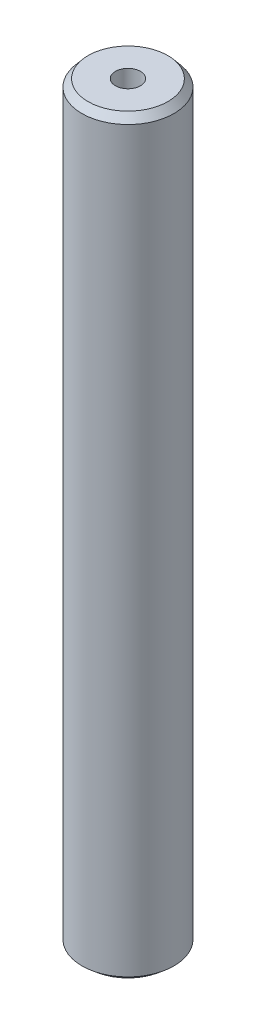
ISO-10303-21;
HEADER;
FILE_DESCRIPTION(('STEP AP214'),'2;1');
FILE_NAME('part.step','',(''),(''),'','','');
FILE_SCHEMA(('AUTOMOTIVE_DESIGN { 1 0 10303 214 1 1 1 1 }'));
ENDSEC;
DATA;
#1=APPLICATION_CONTEXT('core data for automotive mechanical design processes');
#2=APPLICATION_PROTOCOL_DEFINITION('international standard','automotive_design',2000,#1);
#3=PRODUCT_CONTEXT('',#1,'mechanical');
#4=PRODUCT('Part','Part','',(#3));
#5=PRODUCT_RELATED_PRODUCT_CATEGORY('part','',(#4));
#6=PRODUCT_DEFINITION_FORMATION('','',#4);
#7=PRODUCT_DEFINITION_CONTEXT('part definition',#1,'design');
#8=PRODUCT_DEFINITION('design','',#6,#7);
#9=PRODUCT_DEFINITION_SHAPE('','',#8);
#10=(LENGTH_UNIT() NAMED_UNIT(*) SI_UNIT(.MILLI.,.METRE.));
#11=(NAMED_UNIT(*) PLANE_ANGLE_UNIT() SI_UNIT($,.RADIAN.));
#12=(NAMED_UNIT(*) SI_UNIT($,.STERADIAN.) SOLID_ANGLE_UNIT());
#13=UNCERTAINTY_MEASURE_WITH_UNIT(LENGTH_MEASURE(1.E-05),#10,'distance_accuracy_value','');
#14=(GEOMETRIC_REPRESENTATION_CONTEXT(3) GLOBAL_UNCERTAINTY_ASSIGNED_CONTEXT((#13)) GLOBAL_UNIT_ASSIGNED_CONTEXT((#10,
#11,#12)) REPRESENTATION_CONTEXT('',''));
#15=CARTESIAN_POINT('',(0.,0.,0.));
#16=DIRECTION('',(0.,0.,1.));
#17=DIRECTION('',(1.,0.,0.));
#18=AXIS2_PLACEMENT_3D('',#15,#16,#17);
#19=CARTESIAN_POINT('',(0.,285.872211946887,0.));
#20=DIRECTION('',(0.,-1.,0.));
#21=DIRECTION('',(0.,0.,-1.));
#22=AXIS2_PLACEMENT_3D('',#19,#20,#21);
#23=CYLINDRICAL_SURFACE('',#22,17.5);
#24=CARTESIAN_POINT('',(0.,283.094622384006,0.));
#25=DIRECTION('',(0.,1.,0.));
#26=DIRECTION('',(0.,0.,1.));
#27=AXIS2_PLACEMENT_3D('',#24,#25,#26);
#28=CIRCLE('',#27,17.5);
#29=CARTESIAN_POINT('',(0.,283.094622384006,17.5));
#30=VERTEX_POINT('',#29);
#31=EDGE_CURVE('E50',#30,#30,#28,.F.);
#32=ORIENTED_EDGE('',*,*,#31,.T.);
#33=EDGE_LOOP('',(#32));
#34=FACE_BOUND('',#33,.T.);
#35=CARTESIAN_POINT('',(0.,2.32105391104614,0.));
#36=DIRECTION('',(0.,1.,0.));
#37=DIRECTION('',(0.,0.,1.));
#38=AXIS2_PLACEMENT_3D('',#35,#36,#37);
#39=CIRCLE('',#38,17.5);
#40=CARTESIAN_POINT('',(0.,2.32105391104614,17.5));
#41=VERTEX_POINT('',#40);
#42=EDGE_CURVE('E51',#41,#41,#39,.T.);
#43=ORIENTED_EDGE('',*,*,#42,.T.);
#44=EDGE_LOOP('',(#43));
#45=FACE_BOUND('',#44,.T.);
#46=ADVANCED_FACE('F39',(#34,#45),#23,.T.);
#47=CARTESIAN_POINT('',(0.,285.872211946887,0.));
#48=DIRECTION('',(0.,1.,0.));
#49=DIRECTION('',(0.,0.,1.));
#50=AXIS2_PLACEMENT_3D('',#47,#48,#49);
#51=PLANE('',#50);
#52=CARTESIAN_POINT('',(0.,285.872211946887,0.));
#53=DIRECTION('',(0.,1.,0.));
#54=DIRECTION('',(0.,0.,1.));
#55=AXIS2_PLACEMENT_3D('',#52,#53,#54);
#56=CIRCLE('',#55,15.1789460889538);
#57=CARTESIAN_POINT('',(0.,285.872211946887,15.1789460889538));
#58=VERTEX_POINT('',#57);
#59=EDGE_CURVE('E54',#58,#58,#56,.T.);
#60=ORIENTED_EDGE('',*,*,#59,.T.);
#61=EDGE_LOOP('',(#60));
#62=FACE_BOUND('',#61,.T.);
#63=CARTESIAN_POINT('',(0.,285.872211946887,0.));
#64=DIRECTION('',(0.,1.,0.));
#65=DIRECTION('',(0.,0.,1.));
#66=AXIS2_PLACEMENT_3D('',#63,#64,#65);
#67=CIRCLE('',#66,4.76473770354386);
#68=CARTESIAN_POINT('',(0.,285.872211946887,4.76473770354386));
#69=VERTEX_POINT('',#68);
#70=EDGE_CURVE('E58',#69,#69,#67,.T.);
#71=ORIENTED_EDGE('',*,*,#70,.F.);
#72=EDGE_LOOP('',(#71));
#73=FACE_BOUND('',#72,.T.);
#74=ADVANCED_FACE('F69',(#62,#73),#51,.T.);
#75=CARTESIAN_POINT('',(0.,0.,0.));
#76=DIRECTION('',(0.,1.,0.));
#77=DIRECTION('',(0.,0.,1.));
#78=AXIS2_PLACEMENT_3D('',#75,#76,#77);
#79=PLANE('',#78);
#80=CARTESIAN_POINT('',(0.,0.,0.));
#81=DIRECTION('',(0.,1.,0.));
#82=DIRECTION('',(0.,0.,1.));
#83=AXIS2_PLACEMENT_3D('',#80,#81,#82);
#84=CIRCLE('',#83,14.7224104371188);
#85=CARTESIAN_POINT('',(0.,0.,14.7224104371188));
#86=VERTEX_POINT('',#85);
#87=EDGE_CURVE('E10',#86,#86,#84,.F.);
#88=ORIENTED_EDGE('',*,*,#87,.T.);
#89=EDGE_LOOP('',(#88));
#90=FACE_BOUND('',#89,.T.);
#91=CARTESIAN_POINT('',(0.,0.,0.));
#92=DIRECTION('',(0.,1.,0.));
#93=DIRECTION('',(0.,0.,1.));
#94=AXIS2_PLACEMENT_3D('',#91,#92,#93);
#95=CIRCLE('',#94,4.76473770354386);
#96=CARTESIAN_POINT('',(0.,0.,4.76473770354386));
#97=VERTEX_POINT('',#96);
#98=EDGE_CURVE('E63',#97,#97,#95,.T.);
#99=ORIENTED_EDGE('',*,*,#98,.T.);
#100=EDGE_LOOP('',(#99));
#101=FACE_BOUND('',#100,.T.);
#102=ADVANCED_FACE('F75',(#90,#101),#79,.F.);
#103=CARTESIAN_POINT('',(0.,285.872211946887,0.));
#104=DIRECTION('',(0.,-1.,0.));
#105=DIRECTION('',(0.,0.,-1.));
#106=AXIS2_PLACEMENT_3D('',#103,#104,#105);
#107=CYLINDRICAL_SURFACE('',#106,4.76473770354386);
#108=ORIENTED_EDGE('',*,*,#70,.T.);
#109=EDGE_LOOP('',(#108));
#110=FACE_BOUND('',#109,.T.);
#111=ORIENTED_EDGE('',*,*,#98,.F.);
#112=EDGE_LOOP('',(#111));
#113=FACE_BOUND('',#112,.T.);
#114=ADVANCED_FACE('F70',(#110,#113),#107,.F.);
#115=CARTESIAN_POINT('',(0.,285.872211946887,0.));
#116=DIRECTION('',(0.,-1.,0.));
#117=DIRECTION('',(0.,0.,-1.));
#118=AXIS2_PLACEMENT_3D('',#115,#116,#117);
#119=CONICAL_SURFACE('',#118,15.1789460889538,0.696095705731409);
#120=ORIENTED_EDGE('',*,*,#31,.F.);
#121=EDGE_LOOP('',(#120));
#122=FACE_BOUND('',#121,.T.);
#123=ORIENTED_EDGE('',*,*,#59,.F.);
#124=EDGE_LOOP('',(#123));
#125=FACE_BOUND('',#124,.T.);
#126=ADVANCED_FACE('F81',(#122,#125),#119,.T.);
#127=CARTESIAN_POINT('',(0.,2.32105391104614,0.));
#128=DIRECTION('',(0.,1.,0.));
#129=DIRECTION('',(0.,0.,1.));
#130=AXIS2_PLACEMENT_3D('',#127,#128,#129);
#131=CONICAL_SURFACE('',#130,17.5,0.874700621063481);
#132=ORIENTED_EDGE('',*,*,#87,.F.);
#133=EDGE_LOOP('',(#132));
#134=FACE_BOUND('',#133,.T.);
#135=ORIENTED_EDGE('',*,*,#42,.F.);
#136=EDGE_LOOP('',(#135));
#137=FACE_BOUND('',#136,.T.);
#138=ADVANCED_FACE('F45',(#134,#137),#131,.T.);
#139=CLOSED_SHELL('',(#46,#74,#102,#114,#126,#138));
#140=MANIFOLD_SOLID_BREP('B2',#139);
#141=ADVANCED_BREP_SHAPE_REPRESENTATION('',(#18,#140),#14);
#142=SHAPE_DEFINITION_REPRESENTATION(#9,#141);
ENDSEC;
END-ISO-10303-21;
